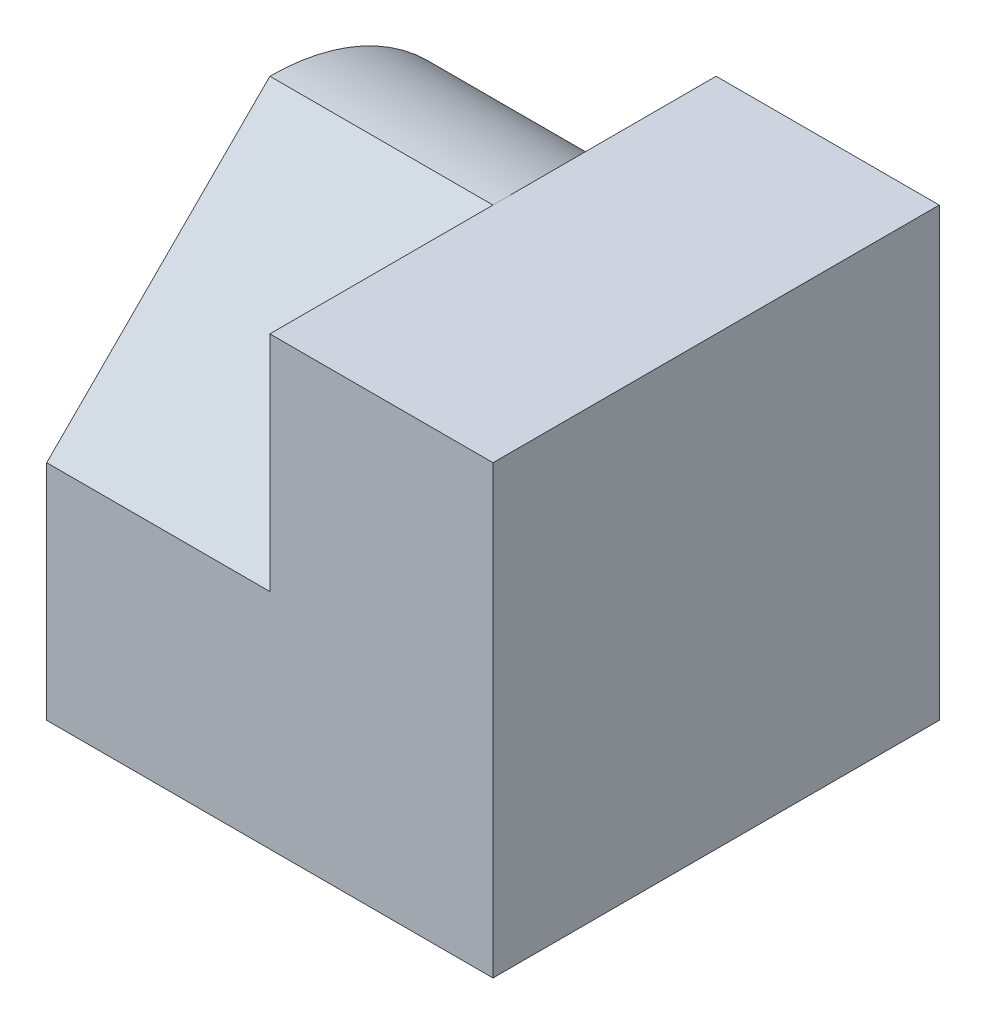
ISO-10303-21;
HEADER;
FILE_DESCRIPTION(('STEP AP214'),'2;1');
FILE_NAME('part.step','',(''),(''),'','','');
FILE_SCHEMA(('AUTOMOTIVE_DESIGN { 1 0 10303 214 1 1 1 1 }'));
ENDSEC;
DATA;
#1=APPLICATION_CONTEXT('core data for automotive mechanical design processes');
#2=APPLICATION_PROTOCOL_DEFINITION('international standard','automotive_design',2000,#1);
#3=PRODUCT_CONTEXT('',#1,'mechanical');
#4=PRODUCT('Part','Part','',(#3));
#5=PRODUCT_RELATED_PRODUCT_CATEGORY('part','',(#4));
#6=PRODUCT_DEFINITION_FORMATION('','',#4);
#7=PRODUCT_DEFINITION_CONTEXT('part definition',#1,'design');
#8=PRODUCT_DEFINITION('design','',#6,#7);
#9=PRODUCT_DEFINITION_SHAPE('','',#8);
#10=(LENGTH_UNIT() NAMED_UNIT(*) SI_UNIT(.MILLI.,.METRE.));
#11=(NAMED_UNIT(*) PLANE_ANGLE_UNIT() SI_UNIT($,.RADIAN.));
#12=(NAMED_UNIT(*) SI_UNIT($,.STERADIAN.) SOLID_ANGLE_UNIT());
#13=UNCERTAINTY_MEASURE_WITH_UNIT(LENGTH_MEASURE(1.E-05),#10,'distance_accuracy_value','');
#14=(GEOMETRIC_REPRESENTATION_CONTEXT(3) GLOBAL_UNCERTAINTY_ASSIGNED_CONTEXT((#13)) GLOBAL_UNIT_ASSIGNED_CONTEXT((#10,
#11,#12)) REPRESENTATION_CONTEXT('',''));
#15=CARTESIAN_POINT('',(0.,0.,0.));
#16=DIRECTION('',(0.,0.,1.));
#17=DIRECTION('',(1.,0.,0.));
#18=AXIS2_PLACEMENT_3D('',#15,#16,#17);
#19=CARTESIAN_POINT('',(-2.,4.,2.));
#20=DIRECTION('',(1.,0.,0.));
#21=DIRECTION('',(0.,0.,-1.));
#22=AXIS2_PLACEMENT_3D('',#19,#20,#21);
#23=PLANE('',#22);
#24=DIRECTION('',(0.,0.707106781186548,-0.707106781186548));
#25=VECTOR('',#24,1.);
#26=CARTESIAN_POINT('',(-2.,2.,2.));
#27=LINE('',#26,#25);
#28=CARTESIAN_POINT('',(-2.,2.,2.));
#29=VERTEX_POINT('',#28);
#30=CARTESIAN_POINT('',(-2.,4.,0.));
#31=VERTEX_POINT('',#30);
#32=EDGE_CURVE('E138',#29,#31,#27,.T.);
#33=ORIENTED_EDGE('',*,*,#32,.T.);
#34=CARTESIAN_POINT('',(-2.,1.99999999999999,0.));
#35=DIRECTION('',(-1.,0.,0.));
#36=DIRECTION('',(0.,0.,1.));
#37=AXIS2_PLACEMENT_3D('',#34,#35,#36);
#38=CIRCLE('',#37,2.00000000000001);
#39=CARTESIAN_POINT('',(-2.,1.99999999999999,-2.));
#40=VERTEX_POINT('',#39);
#41=EDGE_CURVE('E113',#40,#31,#38,.F.);
#42=ORIENTED_EDGE('',*,*,#41,.F.);
#43=DIRECTION('',(0.,-1.,0.));
#44=VECTOR('',#43,1.);
#45=CARTESIAN_POINT('',(-2.,4.,-2.));
#46=LINE('',#45,#44);
#47=CARTESIAN_POINT('',(-2.,0.,-2.));
#48=VERTEX_POINT('',#47);
#49=EDGE_CURVE('E40',#40,#48,#46,.T.);
#50=ORIENTED_EDGE('',*,*,#49,.T.);
#51=DIRECTION('',(0.,0.,1.));
#52=VECTOR('',#51,1.);
#53=CARTESIAN_POINT('',(-2.,0.,2.));
#54=LINE('',#53,#52);
#55=CARTESIAN_POINT('',(-2.,0.,2.));
#56=VERTEX_POINT('',#55);
#57=EDGE_CURVE('E87',#48,#56,#54,.T.);
#58=ORIENTED_EDGE('',*,*,#57,.T.);
#59=DIRECTION('',(0.,-1.,0.));
#60=VECTOR('',#59,1.);
#61=CARTESIAN_POINT('',(-2.,4.,2.));
#62=LINE('',#61,#60);
#63=EDGE_CURVE('E81',#29,#56,#62,.T.);
#64=ORIENTED_EDGE('',*,*,#63,.F.);
#65=EDGE_LOOP('',(#33,#42,#50,#58,#64));
#66=FACE_BOUND('',#65,.T.);
#67=ADVANCED_FACE('F32',(#66),#23,.F.);
#68=CARTESIAN_POINT('',(0.,4.,0.));
#69=DIRECTION('',(0.,-1.,0.));
#70=DIRECTION('',(0.,0.,-1.));
#71=AXIS2_PLACEMENT_3D('',#68,#69,#70);
#72=PLANE('',#71);
#73=DIRECTION('',(0.,0.,-1.));
#74=VECTOR('',#73,1.);
#75=CARTESIAN_POINT('',(0.,4.,0.));
#76=LINE('',#75,#74);
#77=CARTESIAN_POINT('',(0.,4.,2.));
#78=VERTEX_POINT('',#77);
#79=CARTESIAN_POINT('',(0.,4.,0.));
#80=VERTEX_POINT('',#79);
#81=EDGE_CURVE('E47',#78,#80,#76,.T.);
#82=ORIENTED_EDGE('',*,*,#81,.F.);
#83=DIRECTION('',(1.,0.,0.));
#84=VECTOR('',#83,1.);
#85=CARTESIAN_POINT('',(-2.,4.,2.));
#86=LINE('',#85,#84);
#87=CARTESIAN_POINT('',(2.,4.,2.));
#88=VERTEX_POINT('',#87);
#89=EDGE_CURVE('E55',#78,#88,#86,.T.);
#90=ORIENTED_EDGE('',*,*,#89,.T.);
#91=DIRECTION('',(0.,0.,-1.));
#92=VECTOR('',#91,1.);
#93=CARTESIAN_POINT('',(2.,4.,2.));
#94=LINE('',#93,#92);
#95=CARTESIAN_POINT('',(2.,4.,-2.));
#96=VERTEX_POINT('',#95);
#97=EDGE_CURVE('E86',#88,#96,#94,.T.);
#98=ORIENTED_EDGE('',*,*,#97,.T.);
#99=DIRECTION('',(-1.,0.,0.));
#100=VECTOR('',#99,1.);
#101=CARTESIAN_POINT('',(-2.,4.,-2.));
#102=LINE('',#101,#100);
#103=CARTESIAN_POINT('',(0.,4.,-2.));
#104=VERTEX_POINT('',#103);
#105=EDGE_CURVE('E119',#96,#104,#102,.T.);
#106=ORIENTED_EDGE('',*,*,#105,.T.);
#107=DIRECTION('',(0.,0.,-1.));
#108=VECTOR('',#107,1.);
#109=CARTESIAN_POINT('',(0.,4.,0.));
#110=LINE('',#109,#108);
#111=EDGE_CURVE('E127',#80,#104,#110,.T.);
#112=ORIENTED_EDGE('',*,*,#111,.F.);
#113=EDGE_LOOP('',(#82,#90,#98,#106,#112));
#114=FACE_BOUND('',#113,.T.);
#115=ADVANCED_FACE('F123',(#114),#72,.F.);
#116=CARTESIAN_POINT('',(-2.,4.,2.));
#117=DIRECTION('',(0.,0.,-1.));
#118=DIRECTION('',(-1.,0.,0.));
#119=AXIS2_PLACEMENT_3D('',#116,#117,#118);
#120=PLANE('',#119);
#121=DIRECTION('',(-1.,0.,0.));
#122=VECTOR('',#121,1.);
#123=CARTESIAN_POINT('',(0.,2.,2.));
#124=LINE('',#123,#122);
#125=CARTESIAN_POINT('',(0.,2.,2.));
#126=VERTEX_POINT('',#125);
#127=EDGE_CURVE('E130',#126,#29,#124,.T.);
#128=ORIENTED_EDGE('',*,*,#127,.T.);
#129=ORIENTED_EDGE('',*,*,#63,.T.);
#130=DIRECTION('',(1.,0.,0.));
#131=VECTOR('',#130,1.);
#132=CARTESIAN_POINT('',(-2.,0.,2.));
#133=LINE('',#132,#131);
#134=CARTESIAN_POINT('',(2.,0.,2.));
#135=VERTEX_POINT('',#134);
#136=EDGE_CURVE('E74',#56,#135,#133,.T.);
#137=ORIENTED_EDGE('',*,*,#136,.T.);
#138=DIRECTION('',(0.,-1.,0.));
#139=VECTOR('',#138,1.);
#140=CARTESIAN_POINT('',(2.,4.,2.));
#141=LINE('',#140,#139);
#142=EDGE_CURVE('E78',#88,#135,#141,.T.);
#143=ORIENTED_EDGE('',*,*,#142,.F.);
#144=ORIENTED_EDGE('',*,*,#89,.F.);
#145=DIRECTION('',(0.,1.,0.));
#146=VECTOR('',#145,1.);
#147=CARTESIAN_POINT('',(0.,0.,2.));
#148=LINE('',#147,#146);
#149=EDGE_CURVE('E142',#126,#78,#148,.T.);
#150=ORIENTED_EDGE('',*,*,#149,.F.);
#151=EDGE_LOOP('',(#128,#129,#137,#143,#144,#150));
#152=FACE_BOUND('',#151,.T.);
#153=ADVANCED_FACE('F77',(#152),#120,.F.);
#154=CARTESIAN_POINT('',(2.,4.,2.));
#155=DIRECTION('',(-1.,0.,0.));
#156=DIRECTION('',(0.,0.,1.));
#157=AXIS2_PLACEMENT_3D('',#154,#155,#156);
#158=PLANE('',#157);
#159=DIRECTION('',(0.,0.,-1.));
#160=VECTOR('',#159,1.);
#161=CARTESIAN_POINT('',(2.,0.,2.));
#162=LINE('',#161,#160);
#163=CARTESIAN_POINT('',(2.,0.,-2.));
#164=VERTEX_POINT('',#163);
#165=EDGE_CURVE('E92',#135,#164,#162,.T.);
#166=ORIENTED_EDGE('',*,*,#165,.T.);
#167=DIRECTION('',(0.,-1.,0.));
#168=VECTOR('',#167,1.);
#169=CARTESIAN_POINT('',(2.,4.,-2.));
#170=LINE('',#169,#168);
#171=EDGE_CURVE('E11',#96,#164,#170,.T.);
#172=ORIENTED_EDGE('',*,*,#171,.F.);
#173=ORIENTED_EDGE('',*,*,#97,.F.);
#174=ORIENTED_EDGE('',*,*,#142,.T.);
#175=EDGE_LOOP('',(#166,#172,#173,#174));
#176=FACE_BOUND('',#175,.T.);
#177=ADVANCED_FACE('F34',(#176),#158,.F.);
#178=CARTESIAN_POINT('',(-2.,4.,-2.));
#179=DIRECTION('',(0.,0.,1.));
#180=DIRECTION('',(1.,0.,0.));
#181=AXIS2_PLACEMENT_3D('',#178,#179,#180);
#182=PLANE('',#181);
#183=ORIENTED_EDGE('',*,*,#49,.F.);
#184=DIRECTION('',(-1.,0.,0.));
#185=VECTOR('',#184,1.);
#186=CARTESIAN_POINT('',(0.,1.99999999999999,-2.));
#187=LINE('',#186,#185);
#188=CARTESIAN_POINT('',(0.,1.99999999999999,-2.));
#189=VERTEX_POINT('',#188);
#190=EDGE_CURVE('E101',#189,#40,#187,.T.);
#191=ORIENTED_EDGE('',*,*,#190,.F.);
#192=DIRECTION('',(0.,-1.,0.));
#193=VECTOR('',#192,1.);
#194=CARTESIAN_POINT('',(0.,0.,-2.));
#195=LINE('',#194,#193);
#196=EDGE_CURVE('E121',#104,#189,#195,.T.);
#197=ORIENTED_EDGE('',*,*,#196,.F.);
#198=ORIENTED_EDGE('',*,*,#105,.F.);
#199=ORIENTED_EDGE('',*,*,#171,.T.);
#200=DIRECTION('',(-1.,0.,0.));
#201=VECTOR('',#200,1.);
#202=CARTESIAN_POINT('',(-2.,0.,-2.));
#203=LINE('',#202,#201);
#204=EDGE_CURVE('E96',#164,#48,#203,.T.);
#205=ORIENTED_EDGE('',*,*,#204,.T.);
#206=EDGE_LOOP('',(#183,#191,#197,#198,#199,#205));
#207=FACE_BOUND('',#206,.T.);
#208=ADVANCED_FACE('F116',(#207),#182,.F.);
#209=CARTESIAN_POINT('',(0.,0.,0.));
#210=DIRECTION('',(0.,-1.,0.));
#211=DIRECTION('',(0.,0.,-1.));
#212=AXIS2_PLACEMENT_3D('',#209,#210,#211);
#213=PLANE('',#212);
#214=ORIENTED_EDGE('',*,*,#165,.F.);
#215=ORIENTED_EDGE('',*,*,#136,.F.);
#216=ORIENTED_EDGE('',*,*,#57,.F.);
#217=ORIENTED_EDGE('',*,*,#204,.F.);
#218=EDGE_LOOP('',(#214,#215,#216,#217));
#219=FACE_BOUND('',#218,.T.);
#220=ADVANCED_FACE('F94',(#219),#213,.T.);
#221=CARTESIAN_POINT('',(0.,1.99999999999999,0.));
#222=DIRECTION('',(-1.,0.,0.));
#223=DIRECTION('',(0.,0.,1.));
#224=AXIS2_PLACEMENT_3D('',#221,#222,#223);
#225=CYLINDRICAL_SURFACE('',#224,2.00000000000001);
#226=ORIENTED_EDGE('',*,*,#41,.T.);
#227=DIRECTION('',(-1.,0.,0.));
#228=VECTOR('',#227,1.);
#229=CARTESIAN_POINT('',(0.,4.,0.));
#230=LINE('',#229,#228);
#231=EDGE_CURVE('E97',#80,#31,#230,.T.);
#232=ORIENTED_EDGE('',*,*,#231,.F.);
#233=CARTESIAN_POINT('',(0.,1.99999999999999,0.));
#234=DIRECTION('',(-1.,0.,0.));
#235=DIRECTION('',(0.,0.,1.));
#236=AXIS2_PLACEMENT_3D('',#233,#234,#235);
#237=CIRCLE('',#236,2.00000000000001);
#238=EDGE_CURVE('E133',#189,#80,#237,.F.);
#239=ORIENTED_EDGE('',*,*,#238,.F.);
#240=ORIENTED_EDGE('',*,*,#190,.T.);
#241=EDGE_LOOP('',(#226,#232,#239,#240));
#242=FACE_BOUND('',#241,.T.);
#243=ADVANCED_FACE('F157',(#242),#225,.T.);
#244=CARTESIAN_POINT('',(0.,0.,0.));
#245=DIRECTION('',(-1.,0.,0.));
#246=DIRECTION('',(0.,0.,1.));
#247=AXIS2_PLACEMENT_3D('',#244,#245,#246);
#248=PLANE('',#247);
#249=ORIENTED_EDGE('',*,*,#196,.T.);
#250=ORIENTED_EDGE('',*,*,#238,.T.);
#251=ORIENTED_EDGE('',*,*,#111,.T.);
#252=EDGE_LOOP('',(#249,#250,#251));
#253=FACE_BOUND('',#252,.T.);
#254=ADVANCED_FACE('F154',(#253),#248,.T.);
#255=CARTESIAN_POINT('',(0.,2.,2.));
#256=DIRECTION('',(0.,0.707106781186547,0.707106781186547));
#257=DIRECTION('',(0.,-0.707106781186548,0.707106781186548));
#258=AXIS2_PLACEMENT_3D('',#255,#256,#257);
#259=PLANE('',#258);
#260=ORIENTED_EDGE('',*,*,#32,.F.);
#261=ORIENTED_EDGE('',*,*,#127,.F.);
#262=DIRECTION('',(0.,0.707106781186548,-0.707106781186548));
#263=VECTOR('',#262,1.);
#264=CARTESIAN_POINT('',(0.,2.,2.));
#265=LINE('',#264,#263);
#266=EDGE_CURVE('E140',#126,#80,#265,.T.);
#267=ORIENTED_EDGE('',*,*,#266,.T.);
#268=ORIENTED_EDGE('',*,*,#231,.T.);
#269=EDGE_LOOP('',(#260,#261,#267,#268));
#270=FACE_BOUND('',#269,.T.);
#271=ADVANCED_FACE('F147',(#270),#259,.T.);
#272=CARTESIAN_POINT('',(0.,0.,0.));
#273=DIRECTION('',(-1.,0.,0.));
#274=DIRECTION('',(0.,0.,1.));
#275=AXIS2_PLACEMENT_3D('',#272,#273,#274);
#276=PLANE('',#275);
#277=ORIENTED_EDGE('',*,*,#266,.F.);
#278=ORIENTED_EDGE('',*,*,#149,.T.);
#279=ORIENTED_EDGE('',*,*,#81,.T.);
#280=EDGE_LOOP('',(#277,#278,#279));
#281=FACE_BOUND('',#280,.T.);
#282=ADVANCED_FACE('F162',(#281),#276,.T.);
#283=CLOSED_SHELL('',(#67,#115,#153,#177,#208,#220,#243,#254,#271,#282));
#284=MANIFOLD_SOLID_BREP('B2',#283);
#285=ADVANCED_BREP_SHAPE_REPRESENTATION('',(#18,#284),#14);
#286=SHAPE_DEFINITION_REPRESENTATION(#9,#285);
ENDSEC;
END-ISO-10303-21;
